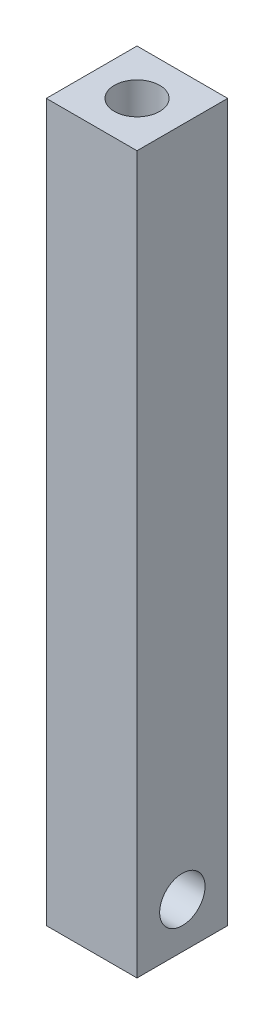
ISO-10303-21;
HEADER;
FILE_DESCRIPTION(('STEP AP214'),'2;1');
FILE_NAME('part.step','',(''),(''),'','','');
FILE_SCHEMA(('AUTOMOTIVE_DESIGN { 1 0 10303 214 1 1 1 1 }'));
ENDSEC;
DATA;
#1=APPLICATION_CONTEXT('core data for automotive mechanical design processes');
#2=APPLICATION_PROTOCOL_DEFINITION('international standard','automotive_design',2000,#1);
#3=PRODUCT_CONTEXT('',#1,'mechanical');
#4=PRODUCT('Part','Part','',(#3));
#5=PRODUCT_RELATED_PRODUCT_CATEGORY('part','',(#4));
#6=PRODUCT_DEFINITION_FORMATION('','',#4);
#7=PRODUCT_DEFINITION_CONTEXT('part definition',#1,'design');
#8=PRODUCT_DEFINITION('design','',#6,#7);
#9=PRODUCT_DEFINITION_SHAPE('','',#8);
#10=(LENGTH_UNIT() NAMED_UNIT(*) SI_UNIT(.MILLI.,.METRE.));
#11=(NAMED_UNIT(*) PLANE_ANGLE_UNIT() SI_UNIT($,.RADIAN.));
#12=(NAMED_UNIT(*) SI_UNIT($,.STERADIAN.) SOLID_ANGLE_UNIT());
#13=UNCERTAINTY_MEASURE_WITH_UNIT(LENGTH_MEASURE(1.E-05),#10,'distance_accuracy_value','');
#14=(GEOMETRIC_REPRESENTATION_CONTEXT(3) GLOBAL_UNCERTAINTY_ASSIGNED_CONTEXT((#13)) GLOBAL_UNIT_ASSIGNED_CONTEXT((#10,
#11,#12)) REPRESENTATION_CONTEXT('',''));
#15=CARTESIAN_POINT('',(0.,0.,0.));
#16=DIRECTION('',(0.,0.,1.));
#17=DIRECTION('',(1.,0.,0.));
#18=AXIS2_PLACEMENT_3D('',#15,#16,#17);
#19=CARTESIAN_POINT('',(10.,0.,0.));
#20=DIRECTION('',(-1.,0.,0.));
#21=DIRECTION('',(0.,0.,1.));
#22=AXIS2_PLACEMENT_3D('',#19,#20,#21);
#23=PLANE('',#22);
#24=DIRECTION('',(0.,1.,0.));
#25=VECTOR('',#24,1.);
#26=CARTESIAN_POINT('',(10.,-39.5,-5.));
#27=LINE('',#26,#25);
#28=CARTESIAN_POINT('',(10.,-39.5,-5.));
#29=VERTEX_POINT('',#28);
#30=CARTESIAN_POINT('',(10.,39.5,-5.));
#31=VERTEX_POINT('',#30);
#32=EDGE_CURVE('E88',#29,#31,#27,.T.);
#33=ORIENTED_EDGE('',*,*,#32,.T.);
#34=DIRECTION('',(0.,0.,1.));
#35=VECTOR('',#34,1.);
#36=CARTESIAN_POINT('',(10.,39.5,5.));
#37=LINE('',#36,#35);
#38=CARTESIAN_POINT('',(10.,39.5,5.));
#39=VERTEX_POINT('',#38);
#40=EDGE_CURVE('E83',#31,#39,#37,.T.);
#41=ORIENTED_EDGE('',*,*,#40,.T.);
#42=DIRECTION('',(0.,-1.,0.));
#43=VECTOR('',#42,1.);
#44=CARTESIAN_POINT('',(10.,-39.5,5.));
#45=LINE('',#44,#43);
#46=CARTESIAN_POINT('',(10.,-39.5,5.));
#47=VERTEX_POINT('',#46);
#48=EDGE_CURVE('E86',#39,#47,#45,.T.);
#49=ORIENTED_EDGE('',*,*,#48,.T.);
#50=DIRECTION('',(0.,0.,-1.));
#51=VECTOR('',#50,1.);
#52=CARTESIAN_POINT('',(10.,-39.5,5.));
#53=LINE('',#52,#51);
#54=EDGE_CURVE('E53',#47,#29,#53,.T.);
#55=ORIENTED_EDGE('',*,*,#54,.T.);
#56=EDGE_LOOP('',(#33,#41,#49,#55));
#57=FACE_BOUND('',#56,.T.);
#58=CARTESIAN_POINT('',(10.,-34.5,0.));
#59=DIRECTION('',(1.,0.,0.));
#60=DIRECTION('',(0.,0.,-1.));
#61=AXIS2_PLACEMENT_3D('',#58,#59,#60);
#62=CIRCLE('',#61,2.5);
#63=CARTESIAN_POINT('',(10.,-34.5,-2.5));
#64=VERTEX_POINT('',#63);
#65=EDGE_CURVE('E103',#64,#64,#62,.T.);
#66=ORIENTED_EDGE('',*,*,#65,.F.);
#67=EDGE_LOOP('',(#66));
#68=FACE_BOUND('',#67,.T.);
#69=ADVANCED_FACE('F36',(#57,#68),#23,.F.);
#70=CARTESIAN_POINT('',(0.,0.,0.));
#71=DIRECTION('',(-1.,0.,0.));
#72=DIRECTION('',(0.,0.,1.));
#73=AXIS2_PLACEMENT_3D('',#70,#71,#72);
#74=PLANE('',#73);
#75=DIRECTION('',(0.,1.,0.));
#76=VECTOR('',#75,1.);
#77=CARTESIAN_POINT('',(0.,-39.5,-5.));
#78=LINE('',#77,#76);
#79=CARTESIAN_POINT('',(0.,-39.5,-5.));
#80=VERTEX_POINT('',#79);
#81=CARTESIAN_POINT('',(0.,39.5,-5.));
#82=VERTEX_POINT('',#81);
#83=EDGE_CURVE('E100',#80,#82,#78,.T.);
#84=ORIENTED_EDGE('',*,*,#83,.F.);
#85=DIRECTION('',(0.,0.,-1.));
#86=VECTOR('',#85,1.);
#87=CARTESIAN_POINT('',(0.,-39.5,5.));
#88=LINE('',#87,#86);
#89=CARTESIAN_POINT('',(0.,-39.5,5.));
#90=VERTEX_POINT('',#89);
#91=EDGE_CURVE('E76',#90,#80,#88,.T.);
#92=ORIENTED_EDGE('',*,*,#91,.F.);
#93=DIRECTION('',(0.,-1.,0.));
#94=VECTOR('',#93,1.);
#95=CARTESIAN_POINT('',(0.,-39.5,5.));
#96=LINE('',#95,#94);
#97=CARTESIAN_POINT('',(0.,39.5,5.));
#98=VERTEX_POINT('',#97);
#99=EDGE_CURVE('E70',#98,#90,#96,.T.);
#100=ORIENTED_EDGE('',*,*,#99,.F.);
#101=DIRECTION('',(0.,0.,1.));
#102=VECTOR('',#101,1.);
#103=CARTESIAN_POINT('',(0.,39.5,5.));
#104=LINE('',#103,#102);
#105=EDGE_CURVE('E92',#82,#98,#104,.T.);
#106=ORIENTED_EDGE('',*,*,#105,.F.);
#107=EDGE_LOOP('',(#84,#92,#100,#106));
#108=FACE_BOUND('',#107,.T.);
#109=CARTESIAN_POINT('',(0.,-34.5,0.));
#110=DIRECTION('',(1.,0.,0.));
#111=DIRECTION('',(0.,0.,-1.));
#112=AXIS2_PLACEMENT_3D('',#109,#110,#111);
#113=CIRCLE('',#112,2.5);
#114=CARTESIAN_POINT('',(0.,-34.5,-2.5));
#115=VERTEX_POINT('',#114);
#116=EDGE_CURVE('E115',#115,#115,#113,.T.);
#117=ORIENTED_EDGE('',*,*,#116,.T.);
#118=EDGE_LOOP('',(#117));
#119=FACE_BOUND('',#118,.T.);
#120=ADVANCED_FACE('F111',(#108,#119),#74,.T.);
#121=CARTESIAN_POINT('',(10.,-39.5,-5.));
#122=DIRECTION('',(0.,0.,1.));
#123=DIRECTION('',(1.,0.,0.));
#124=AXIS2_PLACEMENT_3D('',#121,#122,#123);
#125=PLANE('',#124);
#126=ORIENTED_EDGE('',*,*,#83,.T.);
#127=DIRECTION('',(-1.,0.,0.));
#128=VECTOR('',#127,1.);
#129=CARTESIAN_POINT('',(10.,39.5,-5.));
#130=LINE('',#129,#128);
#131=EDGE_CURVE('E11',#31,#82,#130,.T.);
#132=ORIENTED_EDGE('',*,*,#131,.F.);
#133=ORIENTED_EDGE('',*,*,#32,.F.);
#134=DIRECTION('',(-1.,0.,0.));
#135=VECTOR('',#134,1.);
#136=CARTESIAN_POINT('',(10.,-39.5,-5.));
#137=LINE('',#136,#135);
#138=EDGE_CURVE('E96',#29,#80,#137,.T.);
#139=ORIENTED_EDGE('',*,*,#138,.T.);
#140=EDGE_LOOP('',(#126,#132,#133,#139));
#141=FACE_BOUND('',#140,.T.);
#142=ADVANCED_FACE('F38',(#141),#125,.F.);
#143=CARTESIAN_POINT('',(10.,39.5,5.));
#144=DIRECTION('',(0.,-1.,0.));
#145=DIRECTION('',(0.,0.,-1.));
#146=AXIS2_PLACEMENT_3D('',#143,#144,#145);
#147=PLANE('',#146);
#148=CARTESIAN_POINT('',(5.,39.5,0.));
#149=DIRECTION('',(0.,1.,0.));
#150=DIRECTION('',(0.,0.,1.));
#151=AXIS2_PLACEMENT_3D('',#148,#149,#150);
#152=CIRCLE('',#151,2.5);
#153=CARTESIAN_POINT('',(5.,39.5,2.5));
#154=VERTEX_POINT('',#153);
#155=EDGE_CURVE('E121',#154,#154,#152,.T.);
#156=ORIENTED_EDGE('',*,*,#155,.F.);
#157=EDGE_LOOP('',(#156));
#158=FACE_BOUND('',#157,.T.);
#159=ORIENTED_EDGE('',*,*,#105,.T.);
#160=DIRECTION('',(-1.,0.,0.));
#161=VECTOR('',#160,1.);
#162=CARTESIAN_POINT('',(10.,39.5,5.));
#163=LINE('',#162,#161);
#164=EDGE_CURVE('E45',#39,#98,#163,.T.);
#165=ORIENTED_EDGE('',*,*,#164,.F.);
#166=ORIENTED_EDGE('',*,*,#40,.F.);
#167=ORIENTED_EDGE('',*,*,#131,.T.);
#168=EDGE_LOOP('',(#159,#165,#166,#167));
#169=FACE_BOUND('',#168,.T.);
#170=ADVANCED_FACE('F91',(#158,#169),#147,.F.);
#171=CARTESIAN_POINT('',(10.,-39.5,5.));
#172=DIRECTION('',(0.,0.,-1.));
#173=DIRECTION('',(-1.,0.,0.));
#174=AXIS2_PLACEMENT_3D('',#171,#172,#173);
#175=PLANE('',#174);
#176=ORIENTED_EDGE('',*,*,#99,.T.);
#177=DIRECTION('',(-1.,0.,0.));
#178=VECTOR('',#177,1.);
#179=CARTESIAN_POINT('',(10.,-39.5,5.));
#180=LINE('',#179,#178);
#181=EDGE_CURVE('E93',#47,#90,#180,.T.);
#182=ORIENTED_EDGE('',*,*,#181,.F.);
#183=ORIENTED_EDGE('',*,*,#48,.F.);
#184=ORIENTED_EDGE('',*,*,#164,.T.);
#185=EDGE_LOOP('',(#176,#182,#183,#184));
#186=FACE_BOUND('',#185,.T.);
#187=ADVANCED_FACE('F94',(#186),#175,.F.);
#188=CARTESIAN_POINT('',(10.,-39.5,5.));
#189=DIRECTION('',(0.,1.,0.));
#190=DIRECTION('',(0.,0.,1.));
#191=AXIS2_PLACEMENT_3D('',#188,#189,#190);
#192=PLANE('',#191);
#193=ORIENTED_EDGE('',*,*,#91,.T.);
#194=ORIENTED_EDGE('',*,*,#138,.F.);
#195=ORIENTED_EDGE('',*,*,#54,.F.);
#196=ORIENTED_EDGE('',*,*,#181,.T.);
#197=EDGE_LOOP('',(#193,#194,#195,#196));
#198=FACE_BOUND('',#197,.T.);
#199=ADVANCED_FACE('F108',(#198),#192,.F.);
#200=CARTESIAN_POINT('',(10.,-34.5,0.));
#201=DIRECTION('',(-1.,0.,0.));
#202=DIRECTION('',(0.,0.,1.));
#203=AXIS2_PLACEMENT_3D('',#200,#201,#202);
#204=CYLINDRICAL_SURFACE('',#203,2.5);
#205=ORIENTED_EDGE('',*,*,#65,.T.);
#206=EDGE_LOOP('',(#205));
#207=FACE_BOUND('',#206,.T.);
#208=ORIENTED_EDGE('',*,*,#116,.F.);
#209=EDGE_LOOP('',(#208));
#210=FACE_BOUND('',#209,.T.);
#211=ADVANCED_FACE('F132',(#207,#210),#204,.F.);
#212=CARTESIAN_POINT('',(5.,34.5,0.));
#213=DIRECTION('',(0.,1.,0.));
#214=DIRECTION('',(0.,0.,1.));
#215=AXIS2_PLACEMENT_3D('',#212,#213,#214);
#216=CYLINDRICAL_SURFACE('',#215,2.5);
#217=CARTESIAN_POINT('',(5.,34.5,0.));
#218=DIRECTION('',(0.,1.,0.));
#219=DIRECTION('',(0.,0.,1.));
#220=AXIS2_PLACEMENT_3D('',#217,#218,#219);
#221=CIRCLE('',#220,2.5);
#222=CARTESIAN_POINT('',(5.,34.5,2.5));
#223=VERTEX_POINT('',#222);
#224=EDGE_CURVE('E118',#223,#223,#221,.T.);
#225=ORIENTED_EDGE('',*,*,#224,.F.);
#226=EDGE_LOOP('',(#225));
#227=FACE_BOUND('',#226,.T.);
#228=ORIENTED_EDGE('',*,*,#155,.T.);
#229=EDGE_LOOP('',(#228));
#230=FACE_BOUND('',#229,.T.);
#231=ADVANCED_FACE('F129',(#227,#230),#216,.F.);
#232=CARTESIAN_POINT('',(5.,34.5,0.));
#233=DIRECTION('',(0.,1.,0.));
#234=DIRECTION('',(0.,0.,1.));
#235=AXIS2_PLACEMENT_3D('',#232,#233,#234);
#236=PLANE('',#235);
#237=ORIENTED_EDGE('',*,*,#224,.T.);
#238=EDGE_LOOP('',(#237));
#239=FACE_BOUND('',#238,.T.);
#240=ADVANCED_FACE('F127',(#239),#236,.T.);
#241=CLOSED_SHELL('',(#69,#120,#142,#170,#187,#199,#211,#231,#240));
#242=MANIFOLD_SOLID_BREP('B2',#241);
#243=ADVANCED_BREP_SHAPE_REPRESENTATION('',(#18,#242),#14);
#244=SHAPE_DEFINITION_REPRESENTATION(#9,#243);
ENDSEC;
END-ISO-10303-21;
